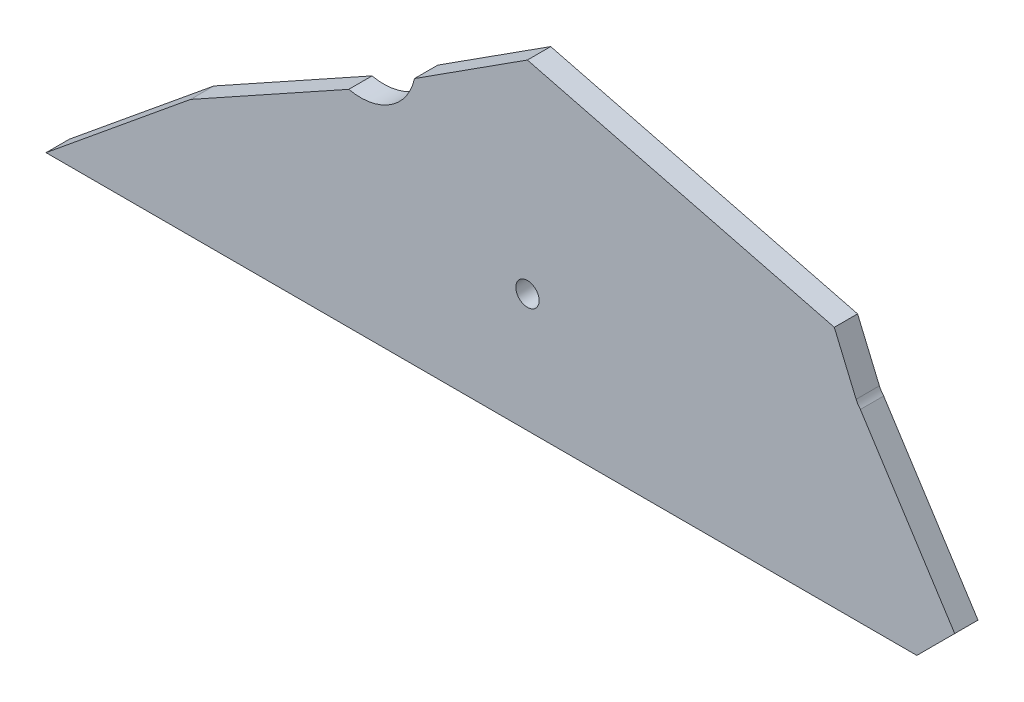
ISO-10303-21;
HEADER;
FILE_DESCRIPTION(('STEP AP214'),'2;1');
FILE_NAME('part.step','',(''),(''),'','','');
FILE_SCHEMA(('AUTOMOTIVE_DESIGN { 1 0 10303 214 1 1 1 1 }'));
ENDSEC;
DATA;
#1=APPLICATION_CONTEXT('core data for automotive mechanical design processes');
#2=APPLICATION_PROTOCOL_DEFINITION('international standard','automotive_design',2000,#1);
#3=PRODUCT_CONTEXT('',#1,'mechanical');
#4=PRODUCT('Part','Part','',(#3));
#5=PRODUCT_RELATED_PRODUCT_CATEGORY('part','',(#4));
#6=PRODUCT_DEFINITION_FORMATION('','',#4);
#7=PRODUCT_DEFINITION_CONTEXT('part definition',#1,'design');
#8=PRODUCT_DEFINITION('design','',#6,#7);
#9=PRODUCT_DEFINITION_SHAPE('','',#8);
#10=(LENGTH_UNIT() NAMED_UNIT(*) SI_UNIT(.MILLI.,.METRE.));
#11=(NAMED_UNIT(*) PLANE_ANGLE_UNIT() SI_UNIT($,.RADIAN.));
#12=(NAMED_UNIT(*) SI_UNIT($,.STERADIAN.) SOLID_ANGLE_UNIT());
#13=UNCERTAINTY_MEASURE_WITH_UNIT(LENGTH_MEASURE(1.E-05),#10,'distance_accuracy_value','');
#14=(GEOMETRIC_REPRESENTATION_CONTEXT(3) GLOBAL_UNCERTAINTY_ASSIGNED_CONTEXT((#13)) GLOBAL_UNIT_ASSIGNED_CONTEXT((#10,
#11,#12)) REPRESENTATION_CONTEXT('',''));
#15=CARTESIAN_POINT('',(0.,0.,0.));
#16=DIRECTION('',(0.,0.,1.));
#17=DIRECTION('',(1.,0.,0.));
#18=AXIS2_PLACEMENT_3D('',#15,#16,#17);
#19=CARTESIAN_POINT('',(-201.501450471915,-50.8387635668806,10.));
#20=DIRECTION('',(0.633617371921876,-0.773646576932138,0.));
#21=DIRECTION('',(0.773646576932138,0.633617371921876,0.));
#22=AXIS2_PLACEMENT_3D('',#19,#20,#21);
#23=PLANE('',#22);
#24=DIRECTION('',(-0.773646576932138,-0.633617371921876,0.));
#25=VECTOR('',#24,1.);
#26=CARTESIAN_POINT('',(-201.501450471915,-50.8387635668806,0.));
#27=LINE('',#26,#25);
#28=CARTESIAN_POINT('',(-139.42733894672,0.,0.));
#29=VERTEX_POINT('',#28);
#30=CARTESIAN_POINT('',(-201.501450471915,-50.8387635668806,0.));
#31=VERTEX_POINT('',#30);
#32=EDGE_CURVE('E148',#29,#31,#27,.T.);
#33=ORIENTED_EDGE('',*,*,#32,.T.);
#34=DIRECTION('',(0.,0.,-1.));
#35=VECTOR('',#34,1.);
#36=CARTESIAN_POINT('',(-201.501450471915,-50.8387635668806,10.));
#37=LINE('',#36,#35);
#38=CARTESIAN_POINT('',(-201.501450471915,-50.8387635668806,10.));
#39=VERTEX_POINT('',#38);
#40=EDGE_CURVE('E11',#39,#31,#37,.T.);
#41=ORIENTED_EDGE('',*,*,#40,.F.);
#42=DIRECTION('',(-0.773646576932138,-0.633617371921876,0.));
#43=VECTOR('',#42,1.);
#44=CARTESIAN_POINT('',(-201.501450471915,-50.8387635668806,10.));
#45=LINE('',#44,#43);
#46=CARTESIAN_POINT('',(-139.42733894672,0.,10.));
#47=VERTEX_POINT('',#46);
#48=EDGE_CURVE('E167',#47,#39,#45,.T.);
#49=ORIENTED_EDGE('',*,*,#48,.F.);
#50=DIRECTION('',(0.,0.,-1.));
#51=VECTOR('',#50,1.);
#52=CARTESIAN_POINT('',(-139.42733894672,0.,10.));
#53=LINE('',#52,#51);
#54=EDGE_CURVE('E144',#47,#29,#53,.T.);
#55=ORIENTED_EDGE('',*,*,#54,.T.);
#56=EDGE_LOOP('',(#33,#41,#49,#55));
#57=FACE_BOUND('',#56,.T.);
#58=ADVANCED_FACE('F40',(#57),#23,.F.);
#59=CARTESIAN_POINT('',(-201.501450471915,-50.8387635668806,10.));
#60=DIRECTION('',(0.,1.,0.));
#61=DIRECTION('',(-1.,0.,0.));
#62=AXIS2_PLACEMENT_3D('',#59,#60,#61);
#63=PLANE('',#62);
#64=DIRECTION('',(1.,0.,0.));
#65=VECTOR('',#64,1.);
#66=CARTESIAN_POINT('',(-201.501450471915,-50.8387635668806,0.));
#67=LINE('',#66,#65);
#68=CARTESIAN_POINT('',(172.498549528085,-50.8387635668806,0.));
#69=VERTEX_POINT('',#68);
#70=EDGE_CURVE('E151',#31,#69,#67,.T.);
#71=ORIENTED_EDGE('',*,*,#70,.T.);
#72=DIRECTION('',(0.,0.,-1.));
#73=VECTOR('',#72,1.);
#74=CARTESIAN_POINT('',(172.498549528085,-50.8387635668806,10.));
#75=LINE('',#74,#73);
#76=CARTESIAN_POINT('',(172.498549528085,-50.8387635668806,10.));
#77=VERTEX_POINT('',#76);
#78=EDGE_CURVE('E48',#77,#69,#75,.T.);
#79=ORIENTED_EDGE('',*,*,#78,.F.);
#80=DIRECTION('',(1.,0.,0.));
#81=VECTOR('',#80,1.);
#82=CARTESIAN_POINT('',(-201.501450471915,-50.8387635668806,10.));
#83=LINE('',#82,#81);
#84=EDGE_CURVE('E105',#39,#77,#83,.T.);
#85=ORIENTED_EDGE('',*,*,#84,.F.);
#86=ORIENTED_EDGE('',*,*,#40,.T.);
#87=EDGE_LOOP('',(#71,#79,#85,#86));
#88=FACE_BOUND('',#87,.T.);
#89=ADVANCED_FACE('F237',(#88),#63,.F.);
#90=CARTESIAN_POINT('',(172.498549528085,-50.8387635668806,10.));
#91=DIRECTION('',(-0.707106781186547,0.707106781186548,0.));
#92=DIRECTION('',(-0.707106781186548,-0.707106781186547,0.));
#93=AXIS2_PLACEMENT_3D('',#90,#91,#92);
#94=PLANE('',#93);
#95=DIRECTION('',(0.707106781186548,0.707106781186547,0.));
#96=VECTOR('',#95,1.);
#97=CARTESIAN_POINT('',(172.498549528085,-50.8387635668806,0.));
#98=LINE('',#97,#96);
#99=CARTESIAN_POINT('',(188.762005495376,-34.5753075995901,0.));
#100=VERTEX_POINT('',#99);
#101=EDGE_CURVE('E154',#69,#100,#98,.T.);
#102=ORIENTED_EDGE('',*,*,#101,.T.);
#103=DIRECTION('',(0.,0.,-1.));
#104=VECTOR('',#103,1.);
#105=CARTESIAN_POINT('',(188.762005495376,-34.5753075995901,10.));
#106=LINE('',#105,#104);
#107=CARTESIAN_POINT('',(188.762005495376,-34.5753075995901,10.));
#108=VERTEX_POINT('',#107);
#109=EDGE_CURVE('E180',#108,#100,#106,.T.);
#110=ORIENTED_EDGE('',*,*,#109,.F.);
#111=DIRECTION('',(0.707106781186548,0.707106781186547,0.));
#112=VECTOR('',#111,1.);
#113=CARTESIAN_POINT('',(172.498549528085,-50.8387635668806,10.));
#114=LINE('',#113,#112);
#115=EDGE_CURVE('E188',#77,#108,#114,.T.);
#116=ORIENTED_EDGE('',*,*,#115,.F.);
#117=ORIENTED_EDGE('',*,*,#78,.T.);
#118=EDGE_LOOP('',(#102,#110,#116,#117));
#119=FACE_BOUND('',#118,.T.);
#120=ADVANCED_FACE('F186',(#119),#94,.F.);
#121=CARTESIAN_POINT('',(188.762005495376,-34.5753075995901,10.));
#122=DIRECTION('',(-0.841476923345267,-0.54029305703237,0.));
#123=DIRECTION('',(0.54029305703237,-0.841476923345267,0.));
#124=AXIS2_PLACEMENT_3D('',#121,#122,#123);
#125=PLANE('',#124);
#126=DIRECTION('',(-0.54029305703237,0.841476923345267,0.));
#127=VECTOR('',#126,1.);
#128=CARTESIAN_POINT('',(188.762005495376,-34.5753075995901,0.));
#129=LINE('',#128,#127);
#130=CARTESIAN_POINT('',(148.240026217948,28.535461651305,0.));
#131=VERTEX_POINT('',#130);
#132=EDGE_CURVE('E156',#100,#131,#129,.T.);
#133=ORIENTED_EDGE('',*,*,#132,.T.);
#134=DIRECTION('',(0.,0.,-1.));
#135=VECTOR('',#134,1.);
#136=CARTESIAN_POINT('',(148.240026217948,28.535461651305,10.));
#137=LINE('',#136,#135);
#138=CARTESIAN_POINT('',(148.240026217948,28.535461651305,10.));
#139=VERTEX_POINT('',#138);
#140=EDGE_CURVE('E177',#139,#131,#137,.T.);
#141=ORIENTED_EDGE('',*,*,#140,.F.);
#142=DIRECTION('',(-0.54029305703237,0.841476923345267,0.));
#143=VECTOR('',#142,1.);
#144=CARTESIAN_POINT('',(188.762005495376,-34.5753075995901,10.));
#145=LINE('',#144,#143);
#146=EDGE_CURVE('E206',#108,#139,#145,.T.);
#147=ORIENTED_EDGE('',*,*,#146,.F.);
#148=ORIENTED_EDGE('',*,*,#109,.T.);
#149=EDGE_LOOP('',(#133,#141,#147,#148));
#150=FACE_BOUND('',#149,.T.);
#151=ADVANCED_FACE('F197',(#150),#125,.F.);
#152=CARTESIAN_POINT('',(155.620113733505,35.2833730513396,10.));
#153=DIRECTION('',(0.,0.,-1.));
#154=DIRECTION('',(-1.,0.,0.));
#155=AXIS2_PLACEMENT_3D('',#152,#153,#154);
#156=CYLINDRICAL_SURFACE('',#155,10.);
#157=CARTESIAN_POINT('',(155.620113733505,35.2833730513396,0.));
#158=DIRECTION('',(0.,0.,-1.));
#159=DIRECTION('',(-1.,0.,0.));
#160=AXIS2_PLACEMENT_3D('',#157,#158,#159);
#161=CIRCLE('',#160,10.);
#162=CARTESIAN_POINT('',(146.412969402026,31.3810028409028,0.));
#163=VERTEX_POINT('',#162);
#164=EDGE_CURVE('E158',#131,#163,#161,.T.);
#165=ORIENTED_EDGE('',*,*,#164,.T.);
#166=DIRECTION('',(0.,0.,-1.));
#167=VECTOR('',#166,1.);
#168=CARTESIAN_POINT('',(146.412969402026,31.3810028409028,10.));
#169=LINE('',#168,#167);
#170=CARTESIAN_POINT('',(146.412969402026,31.3810028409028,10.));
#171=VERTEX_POINT('',#170);
#172=EDGE_CURVE('E174',#171,#163,#169,.T.);
#173=ORIENTED_EDGE('',*,*,#172,.F.);
#174=CARTESIAN_POINT('',(155.620113733505,35.2833730513396,10.));
#175=DIRECTION('',(0.,0.,-1.));
#176=DIRECTION('',(-1.,0.,0.));
#177=AXIS2_PLACEMENT_3D('',#174,#175,#176);
#178=CIRCLE('',#177,10.);
#179=EDGE_CURVE('E203',#139,#171,#178,.T.);
#180=ORIENTED_EDGE('',*,*,#179,.F.);
#181=ORIENTED_EDGE('',*,*,#140,.T.);
#182=EDGE_LOOP('',(#165,#173,#180,#181));
#183=FACE_BOUND('',#182,.T.);
#184=ADVANCED_FACE('F201',(#183),#156,.F.);
#185=CARTESIAN_POINT('',(146.412969402026,31.3810028409028,10.));
#186=DIRECTION('',(-0.920714433147953,-0.390237021043679,0.));
#187=DIRECTION('',(0.390237021043679,-0.920714433147953,0.));
#188=AXIS2_PLACEMENT_3D('',#185,#186,#187);
#189=PLANE('',#188);
#190=DIRECTION('',(-0.390237021043679,0.920714433147953,0.));
#191=VECTOR('',#190,1.);
#192=CARTESIAN_POINT('',(146.412969402026,31.3810028409028,0.));
#193=LINE('',#192,#191);
#194=CARTESIAN_POINT('',(137.047280896977,53.4781492364537,0.));
#195=VERTEX_POINT('',#194);
#196=EDGE_CURVE('E160',#163,#195,#193,.T.);
#197=ORIENTED_EDGE('',*,*,#196,.T.);
#198=DIRECTION('',(0.,0.,-1.));
#199=VECTOR('',#198,1.);
#200=CARTESIAN_POINT('',(137.047280896977,53.4781492364537,10.));
#201=LINE('',#200,#199);
#202=CARTESIAN_POINT('',(137.047280896977,53.4781492364537,10.));
#203=VERTEX_POINT('',#202);
#204=EDGE_CURVE('E171',#203,#195,#201,.T.);
#205=ORIENTED_EDGE('',*,*,#204,.F.);
#206=DIRECTION('',(-0.390237021043679,0.920714433147953,0.));
#207=VECTOR('',#206,1.);
#208=CARTESIAN_POINT('',(146.412969402026,31.3810028409028,10.));
#209=LINE('',#208,#207);
#210=EDGE_CURVE('E205',#171,#203,#209,.T.);
#211=ORIENTED_EDGE('',*,*,#210,.F.);
#212=ORIENTED_EDGE('',*,*,#172,.T.);
#213=EDGE_LOOP('',(#197,#205,#211,#212));
#214=FACE_BOUND('',#213,.T.);
#215=ADVANCED_FACE('F249',(#214),#189,.F.);
#216=CARTESIAN_POINT('',(137.047280896977,53.4781492364537,10.));
#217=DIRECTION('',(-0.246380928079217,-0.969173069311578,0.));
#218=DIRECTION('',(0.969173069311578,-0.246380928079217,0.));
#219=AXIS2_PLACEMENT_3D('',#216,#217,#218);
#220=PLANE('',#219);
#221=DIRECTION('',(-0.969173069311578,0.246380928079217,0.));
#222=VECTOR('',#221,1.);
#223=CARTESIAN_POINT('',(137.047280896977,53.4781492364537,0.));
#224=LINE('',#223,#222);
#225=CARTESIAN_POINT('',(5.23974347060274,86.9859554552272,0.));
#226=VERTEX_POINT('',#225);
#227=EDGE_CURVE('E162',#195,#226,#224,.T.);
#228=ORIENTED_EDGE('',*,*,#227,.T.);
#229=DIRECTION('',(0.,0.,-1.));
#230=VECTOR('',#229,1.);
#231=CARTESIAN_POINT('',(5.23974347060274,86.9859554552272,10.));
#232=LINE('',#231,#230);
#233=CARTESIAN_POINT('',(5.23974347060274,86.9859554552272,10.));
#234=VERTEX_POINT('',#233);
#235=EDGE_CURVE('E139',#234,#226,#232,.T.);
#236=ORIENTED_EDGE('',*,*,#235,.F.);
#237=DIRECTION('',(-0.969173069311578,0.246380928079217,0.));
#238=VECTOR('',#237,1.);
#239=CARTESIAN_POINT('',(137.047280896977,53.4781492364537,10.));
#240=LINE('',#239,#238);
#241=EDGE_CURVE('E130',#203,#234,#240,.T.);
#242=ORIENTED_EDGE('',*,*,#241,.F.);
#243=ORIENTED_EDGE('',*,*,#204,.T.);
#244=EDGE_LOOP('',(#228,#236,#242,#243));
#245=FACE_BOUND('',#244,.T.);
#246=ADVANCED_FACE('F246',(#245),#220,.F.);
#247=CARTESIAN_POINT('',(5.23974347060274,86.9859554552272,10.));
#248=DIRECTION('',(0.54029305703237,-0.841476923345267,0.));
#249=DIRECTION('',(0.841476923345267,0.54029305703237,0.));
#250=AXIS2_PLACEMENT_3D('',#247,#248,#249);
#251=PLANE('',#250);
#252=DIRECTION('',(-0.841476923345267,-0.54029305703237,0.));
#253=VECTOR('',#252,1.);
#254=CARTESIAN_POINT('',(5.23974347060274,86.9859554552272,0.));
#255=LINE('',#254,#253);
#256=CARTESIAN_POINT('',(-43.2503870220919,55.8515534140594,0.));
#257=VERTEX_POINT('',#256);
#258=EDGE_CURVE('E138',#226,#257,#255,.T.);
#259=ORIENTED_EDGE('',*,*,#258,.T.);
#260=DIRECTION('',(0.,0.,-1.));
#261=VECTOR('',#260,1.);
#262=CARTESIAN_POINT('',(-43.2503870220919,55.8515534140594,10.));
#263=LINE('',#262,#261);
#264=CARTESIAN_POINT('',(-43.2503870220919,55.8515534140594,10.));
#265=VERTEX_POINT('',#264);
#266=EDGE_CURVE('E135',#265,#257,#263,.T.);
#267=ORIENTED_EDGE('',*,*,#266,.F.);
#268=DIRECTION('',(-0.841476923345267,-0.54029305703237,0.));
#269=VECTOR('',#268,1.);
#270=CARTESIAN_POINT('',(5.23974347060274,86.9859554552272,10.));
#271=LINE('',#270,#269);
#272=EDGE_CURVE('E124',#234,#265,#271,.T.);
#273=ORIENTED_EDGE('',*,*,#272,.F.);
#274=ORIENTED_EDGE('',*,*,#235,.T.);
#275=EDGE_LOOP('',(#259,#267,#273,#274));
#276=FACE_BOUND('',#275,.T.);
#277=ADVANCED_FACE('F136',(#276),#251,.F.);
#278=CARTESIAN_POINT('',(-66.433495499391,60.9047665707354,10.));
#279=DIRECTION('',(0.,0.,-1.));
#280=DIRECTION('',(-1.,0.,0.));
#281=AXIS2_PLACEMENT_3D('',#278,#279,#280);
#282=CYLINDRICAL_SURFACE('',#281,23.7274415366896);
#283=CARTESIAN_POINT('',(-66.433495499391,60.9047665707354,0.));
#284=DIRECTION('',(0.,0.,-1.));
#285=DIRECTION('',(-1.,0.,0.));
#286=AXIS2_PLACEMENT_3D('',#283,#284,#285);
#287=CIRCLE('',#286,23.7274415366896);
#288=CARTESIAN_POINT('',(-71.4867086560671,37.7216580934362,0.));
#289=VERTEX_POINT('',#288);
#290=EDGE_CURVE('E91',#257,#289,#287,.T.);
#291=ORIENTED_EDGE('',*,*,#290,.T.);
#292=DIRECTION('',(0.,0.,-1.));
#293=VECTOR('',#292,1.);
#294=CARTESIAN_POINT('',(-71.4867086560671,37.7216580934362,10.));
#295=LINE('',#294,#293);
#296=CARTESIAN_POINT('',(-71.4867086560671,37.7216580934362,10.));
#297=VERTEX_POINT('',#296);
#298=EDGE_CURVE('E140',#297,#289,#295,.T.);
#299=ORIENTED_EDGE('',*,*,#298,.F.);
#300=CARTESIAN_POINT('',(-66.433495499391,60.9047665707354,10.));
#301=DIRECTION('',(0.,0.,-1.));
#302=DIRECTION('',(-1.,0.,0.));
#303=AXIS2_PLACEMENT_3D('',#300,#301,#302);
#304=CIRCLE('',#303,23.7274415366896);
#305=EDGE_CURVE('E128',#265,#297,#304,.T.);
#306=ORIENTED_EDGE('',*,*,#305,.F.);
#307=ORIENTED_EDGE('',*,*,#266,.T.);
#308=EDGE_LOOP('',(#291,#299,#306,#307));
#309=FACE_BOUND('',#308,.T.);
#310=ADVANCED_FACE('F142',(#309),#282,.F.);
#311=CARTESIAN_POINT('',(-71.4867086560671,37.7216580934362,10.));
#312=DIRECTION('',(0.485415405076976,-0.87428364076766,0.));
#313=DIRECTION('',(0.87428364076766,0.485415405076976,0.));
#314=AXIS2_PLACEMENT_3D('',#311,#312,#313);
#315=PLANE('',#314);
#316=DIRECTION('',(-0.87428364076766,-0.485415405076976,0.));
#317=VECTOR('',#316,1.);
#318=CARTESIAN_POINT('',(-71.4867086560671,37.7216580934362,0.));
#319=LINE('',#318,#317);
#320=EDGE_CURVE('E97',#289,#29,#319,.T.);
#321=ORIENTED_EDGE('',*,*,#320,.T.);
#322=ORIENTED_EDGE('',*,*,#54,.F.);
#323=DIRECTION('',(-0.87428364076766,-0.485415405076976,0.));
#324=VECTOR('',#323,1.);
#325=CARTESIAN_POINT('',(-71.4867086560671,37.7216580934362,10.));
#326=LINE('',#325,#324);
#327=EDGE_CURVE('E56',#297,#47,#326,.T.);
#328=ORIENTED_EDGE('',*,*,#327,.F.);
#329=ORIENTED_EDGE('',*,*,#298,.T.);
#330=EDGE_LOOP('',(#321,#322,#328,#329));
#331=FACE_BOUND('',#330,.T.);
#332=ADVANCED_FACE('F228',(#331),#315,.F.);
#333=CARTESIAN_POINT('',(-66.433495499391,60.9047665707354,10.));
#334=DIRECTION('',(0.,0.,-1.));
#335=DIRECTION('',(-1.,0.,0.));
#336=AXIS2_PLACEMENT_3D('',#333,#334,#335);
#337=PLANE('',#336);
#338=CARTESIAN_POINT('',(5.27415807095774,0.,10.));
#339=DIRECTION('',(0.,0.,1.));
#340=DIRECTION('',(1.,0.,0.));
#341=AXIS2_PLACEMENT_3D('',#338,#339,#340);
#342=CIRCLE('',#341,5.);
#343=CARTESIAN_POINT('',(10.2741580709577,0.,10.));
#344=VERTEX_POINT('',#343);
#345=EDGE_CURVE('E214',#344,#344,#342,.T.);
#346=ORIENTED_EDGE('',*,*,#345,.F.);
#347=EDGE_LOOP('',(#346));
#348=FACE_BOUND('',#347,.T.);
#349=ORIENTED_EDGE('',*,*,#48,.T.);
#350=ORIENTED_EDGE('',*,*,#84,.T.);
#351=ORIENTED_EDGE('',*,*,#115,.T.);
#352=ORIENTED_EDGE('',*,*,#146,.T.);
#353=ORIENTED_EDGE('',*,*,#179,.T.);
#354=ORIENTED_EDGE('',*,*,#210,.T.);
#355=ORIENTED_EDGE('',*,*,#241,.T.);
#356=ORIENTED_EDGE('',*,*,#272,.T.);
#357=ORIENTED_EDGE('',*,*,#305,.T.);
#358=ORIENTED_EDGE('',*,*,#327,.T.);
#359=EDGE_LOOP('',(#349,#350,#351,#352,#353,#354,#355,#356,#357,#358));
#360=FACE_BOUND('',#359,.T.);
#361=ADVANCED_FACE('F126',(#348,#360),#337,.F.);
#362=CARTESIAN_POINT('',(-66.433495499391,60.9047665707354,0.));
#363=DIRECTION('',(0.,0.,-1.));
#364=DIRECTION('',(-1.,0.,0.));
#365=AXIS2_PLACEMENT_3D('',#362,#363,#364);
#366=PLANE('',#365);
#367=CARTESIAN_POINT('',(5.27415807095774,0.,0.));
#368=DIRECTION('',(0.,0.,1.));
#369=DIRECTION('',(1.,0.,0.));
#370=AXIS2_PLACEMENT_3D('',#367,#368,#369);
#371=CIRCLE('',#370,5.);
#372=CARTESIAN_POINT('',(10.2741580709577,0.,0.));
#373=VERTEX_POINT('',#372);
#374=EDGE_CURVE('E152',#373,#373,#371,.T.);
#375=ORIENTED_EDGE('',*,*,#374,.T.);
#376=EDGE_LOOP('',(#375));
#377=FACE_BOUND('',#376,.T.);
#378=ORIENTED_EDGE('',*,*,#32,.F.);
#379=ORIENTED_EDGE('',*,*,#320,.F.);
#380=ORIENTED_EDGE('',*,*,#290,.F.);
#381=ORIENTED_EDGE('',*,*,#258,.F.);
#382=ORIENTED_EDGE('',*,*,#227,.F.);
#383=ORIENTED_EDGE('',*,*,#196,.F.);
#384=ORIENTED_EDGE('',*,*,#164,.F.);
#385=ORIENTED_EDGE('',*,*,#132,.F.);
#386=ORIENTED_EDGE('',*,*,#101,.F.);
#387=ORIENTED_EDGE('',*,*,#70,.F.);
#388=EDGE_LOOP('',(#378,#379,#380,#381,#382,#383,#384,#385,#386,#387));
#389=FACE_BOUND('',#388,.T.);
#390=ADVANCED_FACE('F192',(#377,#389),#366,.T.);
#391=CARTESIAN_POINT('',(5.27415807095774,0.,0.));
#392=DIRECTION('',(0.,0.,1.));
#393=DIRECTION('',(1.,0.,0.));
#394=AXIS2_PLACEMENT_3D('',#391,#392,#393);
#395=CYLINDRICAL_SURFACE('',#394,5.);
#396=ORIENTED_EDGE('',*,*,#374,.F.);
#397=EDGE_LOOP('',(#396));
#398=FACE_BOUND('',#397,.T.);
#399=ORIENTED_EDGE('',*,*,#345,.T.);
#400=EDGE_LOOP('',(#399));
#401=FACE_BOUND('',#400,.T.);
#402=ADVANCED_FACE('F221',(#398,#401),#395,.F.);
#403=CLOSED_SHELL('',(#58,#89,#120,#151,#184,#215,#246,#277,#310,#332,#361,#390,#402));
#404=MANIFOLD_SOLID_BREP('B2',#403);
#405=ADVANCED_BREP_SHAPE_REPRESENTATION('',(#18,#404),#14);
#406=SHAPE_DEFINITION_REPRESENTATION(#9,#405);
ENDSEC;
END-ISO-10303-21;
